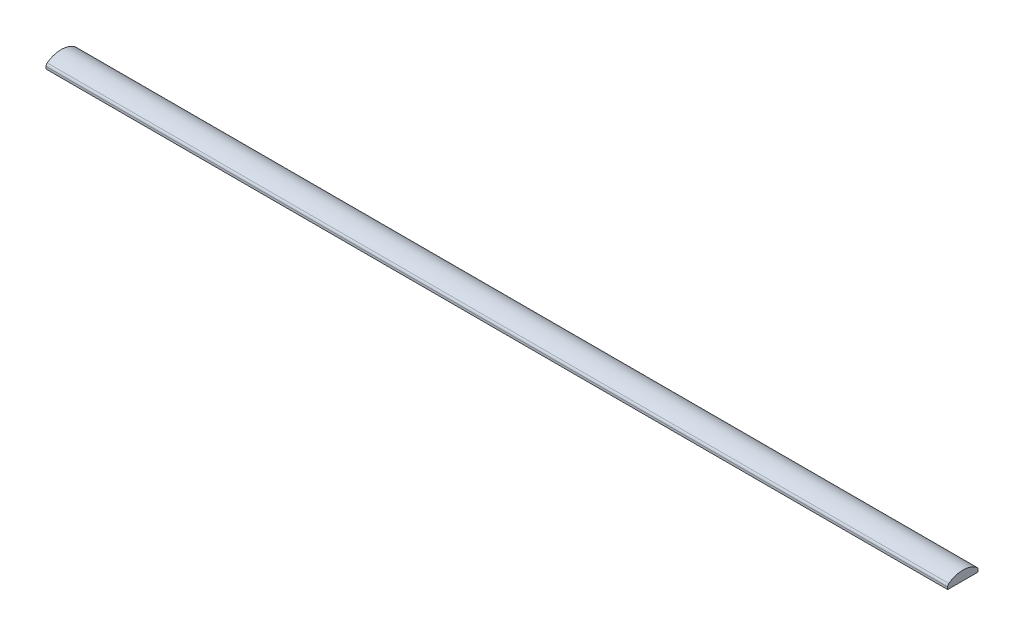
ISO-10303-21;
HEADER;
FILE_DESCRIPTION(('STEP AP214'),'2;1');
FILE_NAME('part.step','',(''),(''),'','','');
FILE_SCHEMA(('AUTOMOTIVE_DESIGN { 1 0 10303 214 1 1 1 1 }'));
ENDSEC;
DATA;
#1=APPLICATION_CONTEXT('core data for automotive mechanical design processes');
#2=APPLICATION_PROTOCOL_DEFINITION('international standard','automotive_design',2000,#1);
#3=PRODUCT_CONTEXT('',#1,'mechanical');
#4=PRODUCT('Part','Part','',(#3));
#5=PRODUCT_RELATED_PRODUCT_CATEGORY('part','',(#4));
#6=PRODUCT_DEFINITION_FORMATION('','',#4);
#7=PRODUCT_DEFINITION_CONTEXT('part definition',#1,'design');
#8=PRODUCT_DEFINITION('design','',#6,#7);
#9=PRODUCT_DEFINITION_SHAPE('','',#8);
#10=(LENGTH_UNIT() NAMED_UNIT(*) SI_UNIT(.MILLI.,.METRE.));
#11=(NAMED_UNIT(*) PLANE_ANGLE_UNIT() SI_UNIT($,.RADIAN.));
#12=(NAMED_UNIT(*) SI_UNIT($,.STERADIAN.) SOLID_ANGLE_UNIT());
#13=UNCERTAINTY_MEASURE_WITH_UNIT(LENGTH_MEASURE(1.E-05),#10,'distance_accuracy_value','');
#14=(GEOMETRIC_REPRESENTATION_CONTEXT(3) GLOBAL_UNCERTAINTY_ASSIGNED_CONTEXT((#13)) GLOBAL_UNIT_ASSIGNED_CONTEXT((#10,
#11,#12)) REPRESENTATION_CONTEXT('',''));
#15=CARTESIAN_POINT('',(0.,0.,0.));
#16=DIRECTION('',(0.,0.,1.));
#17=DIRECTION('',(1.,0.,0.));
#18=AXIS2_PLACEMENT_3D('',#15,#16,#17);
#19=CARTESIAN_POINT('',(150.,-0.625000000000002,5.05));
#20=DIRECTION('',(0.,0.,-1.));
#21=DIRECTION('',(-1.,0.,0.));
#22=AXIS2_PLACEMENT_3D('',#19,#20,#21);
#23=PLANE('',#22);
#24=DIRECTION('',(0.,-1.,0.));
#25=VECTOR('',#24,1.);
#26=CARTESIAN_POINT('',(-150.,-0.625000000000002,5.05));
#27=LINE('',#26,#25);
#28=CARTESIAN_POINT('',(-150.,0.14165776864439,5.05));
#29=VERTEX_POINT('',#28);
#30=CARTESIAN_POINT('',(-150.,-0.625000000000002,5.05));
#31=VERTEX_POINT('',#30);
#32=EDGE_CURVE('E116',#29,#31,#27,.T.);
#33=ORIENTED_EDGE('',*,*,#32,.T.);
#34=DIRECTION('',(-1.,0.,0.));
#35=VECTOR('',#34,1.);
#36=CARTESIAN_POINT('',(150.,-0.625000000000002,5.05));
#37=LINE('',#36,#35);
#38=CARTESIAN_POINT('',(150.,-0.625000000000002,5.05));
#39=VERTEX_POINT('',#38);
#40=EDGE_CURVE('E11',#39,#31,#37,.T.);
#41=ORIENTED_EDGE('',*,*,#40,.F.);
#42=DIRECTION('',(0.,-1.,0.));
#43=VECTOR('',#42,1.);
#44=CARTESIAN_POINT('',(150.,-0.625000000000002,5.05));
#45=LINE('',#44,#43);
#46=CARTESIAN_POINT('',(150.,0.14165776864439,5.05));
#47=VERTEX_POINT('',#46);
#48=EDGE_CURVE('E126',#47,#39,#45,.T.);
#49=ORIENTED_EDGE('',*,*,#48,.F.);
#50=DIRECTION('',(-1.,0.,0.));
#51=VECTOR('',#50,1.);
#52=CARTESIAN_POINT('',(150.,0.14165776864439,5.05));
#53=LINE('',#52,#51);
#54=EDGE_CURVE('E112',#47,#29,#53,.T.);
#55=ORIENTED_EDGE('',*,*,#54,.T.);
#56=EDGE_LOOP('',(#33,#41,#49,#55));
#57=FACE_BOUND('',#56,.T.);
#58=ADVANCED_FACE('F32',(#57),#23,.F.);
#59=CARTESIAN_POINT('',(150.,-0.625000000000002,5.05));
#60=DIRECTION('',(0.,1.,0.));
#61=DIRECTION('',(0.,0.,1.));
#62=AXIS2_PLACEMENT_3D('',#59,#60,#61);
#63=PLANE('',#62);
#64=DIRECTION('',(0.,0.,-1.));
#65=VECTOR('',#64,1.);
#66=CARTESIAN_POINT('',(-150.,-0.625000000000002,5.05));
#67=LINE('',#66,#65);
#68=CARTESIAN_POINT('',(-150.,-0.625000000000001,-5.05));
#69=VERTEX_POINT('',#68);
#70=EDGE_CURVE('E119',#31,#69,#67,.T.);
#71=ORIENTED_EDGE('',*,*,#70,.T.);
#72=DIRECTION('',(-1.,0.,0.));
#73=VECTOR('',#72,1.);
#74=CARTESIAN_POINT('',(150.,-0.625000000000001,-5.05));
#75=LINE('',#74,#73);
#76=CARTESIAN_POINT('',(150.,-0.625000000000001,-5.05));
#77=VERTEX_POINT('',#76);
#78=EDGE_CURVE('E40',#77,#69,#75,.T.);
#79=ORIENTED_EDGE('',*,*,#78,.F.);
#80=DIRECTION('',(0.,0.,-1.));
#81=VECTOR('',#80,1.);
#82=CARTESIAN_POINT('',(150.,-0.625000000000002,5.05));
#83=LINE('',#82,#81);
#84=EDGE_CURVE('E85',#39,#77,#83,.T.);
#85=ORIENTED_EDGE('',*,*,#84,.F.);
#86=ORIENTED_EDGE('',*,*,#40,.T.);
#87=EDGE_LOOP('',(#71,#79,#85,#86));
#88=FACE_BOUND('',#87,.T.);
#89=ADVANCED_FACE('F150',(#88),#63,.F.);
#90=CARTESIAN_POINT('',(150.,-0.625000000000001,-5.05));
#91=DIRECTION('',(0.,0.,1.));
#92=DIRECTION('',(1.,0.,0.));
#93=AXIS2_PLACEMENT_3D('',#90,#91,#92);
#94=PLANE('',#93);
#95=DIRECTION('',(0.,1.,0.));
#96=VECTOR('',#95,1.);
#97=CARTESIAN_POINT('',(-150.,-0.625000000000001,-5.05));
#98=LINE('',#97,#96);
#99=CARTESIAN_POINT('',(-150.,0.141657768644389,-5.05));
#100=VERTEX_POINT('',#99);
#101=EDGE_CURVE('E121',#69,#100,#98,.T.);
#102=ORIENTED_EDGE('',*,*,#101,.T.);
#103=DIRECTION('',(-1.,0.,0.));
#104=VECTOR('',#103,1.);
#105=CARTESIAN_POINT('',(150.,0.141657768644389,-5.05));
#106=LINE('',#105,#104);
#107=CARTESIAN_POINT('',(150.,0.141657768644389,-5.05));
#108=VERTEX_POINT('',#107);
#109=EDGE_CURVE('E107',#108,#100,#106,.T.);
#110=ORIENTED_EDGE('',*,*,#109,.F.);
#111=DIRECTION('',(0.,1.,0.));
#112=VECTOR('',#111,1.);
#113=CARTESIAN_POINT('',(150.,-0.625000000000001,-5.05));
#114=LINE('',#113,#112);
#115=EDGE_CURVE('E98',#77,#108,#114,.T.);
#116=ORIENTED_EDGE('',*,*,#115,.F.);
#117=ORIENTED_EDGE('',*,*,#78,.T.);
#118=EDGE_LOOP('',(#102,#110,#116,#117));
#119=FACE_BOUND('',#118,.T.);
#120=ADVANCED_FACE('F132',(#119),#94,.F.);
#121=CARTESIAN_POINT('',(150.,0.141657768644389,-4.05));
#122=DIRECTION('',(-1.,0.,0.));
#123=DIRECTION('',(0.,0.,1.));
#124=AXIS2_PLACEMENT_3D('',#121,#122,#123);
#125=CYLINDRICAL_SURFACE('',#124,1.);
#126=CARTESIAN_POINT('',(-150.,0.141657768644389,-4.05));
#127=DIRECTION('',(1.,0.,0.));
#128=DIRECTION('',(0.,0.,-1.));
#129=AXIS2_PLACEMENT_3D('',#126,#127,#128);
#130=CIRCLE('',#129,1.);
#131=CARTESIAN_POINT('',(-150.,0.946083288723051,-4.64405351833498));
#132=VERTEX_POINT('',#131);
#133=EDGE_CURVE('E106',#100,#132,#130,.T.);
#134=ORIENTED_EDGE('',*,*,#133,.T.);
#135=DIRECTION('',(-1.,0.,0.));
#136=VECTOR('',#135,1.);
#137=CARTESIAN_POINT('',(150.,0.946083288723051,-4.64405351833498));
#138=LINE('',#137,#136);
#139=CARTESIAN_POINT('',(150.,0.946083288723051,-4.64405351833498));
#140=VERTEX_POINT('',#139);
#141=EDGE_CURVE('E103',#140,#132,#138,.T.);
#142=ORIENTED_EDGE('',*,*,#141,.F.);
#143=CARTESIAN_POINT('',(150.,0.141657768644389,-4.05));
#144=DIRECTION('',(1.,0.,0.));
#145=DIRECTION('',(0.,0.,-1.));
#146=AXIS2_PLACEMENT_3D('',#143,#144,#145);
#147=CIRCLE('',#146,1.);
#148=EDGE_CURVE('E92',#108,#140,#147,.T.);
#149=ORIENTED_EDGE('',*,*,#148,.F.);
#150=ORIENTED_EDGE('',*,*,#109,.T.);
#151=EDGE_LOOP('',(#134,#142,#149,#150));
#152=FACE_BOUND('',#151,.T.);
#153=ADVANCED_FACE('F104',(#152),#125,.T.);
#154=CARTESIAN_POINT('',(150.,-5.34256756756757,0.));
#155=DIRECTION('',(-1.,0.,0.));
#156=DIRECTION('',(0.,0.,1.));
#157=AXIS2_PLACEMENT_3D('',#154,#155,#156);
#158=CYLINDRICAL_SURFACE('',#157,7.81756756756757);
#159=CARTESIAN_POINT('',(-150.,-5.34256756756757,0.));
#160=DIRECTION('',(1.,0.,0.));
#161=DIRECTION('',(0.,0.,1.));
#162=AXIS2_PLACEMENT_3D('',#159,#160,#161);
#163=CIRCLE('',#162,7.81756756756757);
#164=CARTESIAN_POINT('',(-150.,0.94608328872305,4.64405351833499));
#165=VERTEX_POINT('',#164);
#166=EDGE_CURVE('E71',#132,#165,#163,.T.);
#167=ORIENTED_EDGE('',*,*,#166,.T.);
#168=DIRECTION('',(-1.,0.,0.));
#169=VECTOR('',#168,1.);
#170=CARTESIAN_POINT('',(150.,0.94608328872305,4.64405351833499));
#171=LINE('',#170,#169);
#172=CARTESIAN_POINT('',(150.,0.94608328872305,4.64405351833499));
#173=VERTEX_POINT('',#172);
#174=EDGE_CURVE('E108',#173,#165,#171,.T.);
#175=ORIENTED_EDGE('',*,*,#174,.F.);
#176=CARTESIAN_POINT('',(150.,-5.34256756756757,0.));
#177=DIRECTION('',(1.,0.,0.));
#178=DIRECTION('',(0.,0.,1.));
#179=AXIS2_PLACEMENT_3D('',#176,#177,#178);
#180=CIRCLE('',#179,7.81756756756757);
#181=EDGE_CURVE('E96',#140,#173,#180,.T.);
#182=ORIENTED_EDGE('',*,*,#181,.F.);
#183=ORIENTED_EDGE('',*,*,#141,.T.);
#184=EDGE_LOOP('',(#167,#175,#182,#183));
#185=FACE_BOUND('',#184,.T.);
#186=ADVANCED_FACE('F110',(#185),#158,.T.);
#187=CARTESIAN_POINT('',(150.,0.14165776864439,4.05));
#188=DIRECTION('',(-1.,0.,0.));
#189=DIRECTION('',(0.,0.,1.));
#190=AXIS2_PLACEMENT_3D('',#187,#188,#189);
#191=CYLINDRICAL_SURFACE('',#190,1.);
#192=CARTESIAN_POINT('',(-150.,0.14165776864439,4.05));
#193=DIRECTION('',(1.,0.,0.));
#194=DIRECTION('',(0.,0.,1.));
#195=AXIS2_PLACEMENT_3D('',#192,#193,#194);
#196=CIRCLE('',#195,1.);
#197=EDGE_CURVE('E77',#165,#29,#196,.T.);
#198=ORIENTED_EDGE('',*,*,#197,.T.);
#199=ORIENTED_EDGE('',*,*,#54,.F.);
#200=CARTESIAN_POINT('',(150.,0.14165776864439,4.05));
#201=DIRECTION('',(1.,0.,0.));
#202=DIRECTION('',(0.,0.,1.));
#203=AXIS2_PLACEMENT_3D('',#200,#201,#202);
#204=CIRCLE('',#203,1.);
#205=EDGE_CURVE('E48',#173,#47,#204,.T.);
#206=ORIENTED_EDGE('',*,*,#205,.F.);
#207=ORIENTED_EDGE('',*,*,#174,.T.);
#208=EDGE_LOOP('',(#198,#199,#206,#207));
#209=FACE_BOUND('',#208,.T.);
#210=ADVANCED_FACE('F139',(#209),#191,.T.);
#211=CARTESIAN_POINT('',(150.,0.14165776864439,4.05));
#212=DIRECTION('',(-1.,0.,0.));
#213=DIRECTION('',(0.,0.,1.));
#214=AXIS2_PLACEMENT_3D('',#211,#212,#213);
#215=PLANE('',#214);
#216=ORIENTED_EDGE('',*,*,#48,.T.);
#217=ORIENTED_EDGE('',*,*,#84,.T.);
#218=ORIENTED_EDGE('',*,*,#115,.T.);
#219=ORIENTED_EDGE('',*,*,#148,.T.);
#220=ORIENTED_EDGE('',*,*,#181,.T.);
#221=ORIENTED_EDGE('',*,*,#205,.T.);
#222=EDGE_LOOP('',(#216,#217,#218,#219,#220,#221));
#223=FACE_BOUND('',#222,.T.);
#224=ADVANCED_FACE('F94',(#223),#215,.F.);
#225=CARTESIAN_POINT('',(-150.,0.14165776864439,4.05));
#226=DIRECTION('',(-1.,0.,0.));
#227=DIRECTION('',(0.,0.,1.));
#228=AXIS2_PLACEMENT_3D('',#225,#226,#227);
#229=PLANE('',#228);
#230=ORIENTED_EDGE('',*,*,#32,.F.);
#231=ORIENTED_EDGE('',*,*,#197,.F.);
#232=ORIENTED_EDGE('',*,*,#166,.F.);
#233=ORIENTED_EDGE('',*,*,#133,.F.);
#234=ORIENTED_EDGE('',*,*,#101,.F.);
#235=ORIENTED_EDGE('',*,*,#70,.F.);
#236=EDGE_LOOP('',(#230,#231,#232,#233,#234,#235));
#237=FACE_BOUND('',#236,.T.);
#238=ADVANCED_FACE('F135',(#237),#229,.T.);
#239=CLOSED_SHELL('',(#58,#89,#120,#153,#186,#210,#224,#238));
#240=MANIFOLD_SOLID_BREP('B2',#239);
#241=ADVANCED_BREP_SHAPE_REPRESENTATION('',(#18,#240),#14);
#242=SHAPE_DEFINITION_REPRESENTATION(#9,#241);
ENDSEC;
END-ISO-10303-21;
